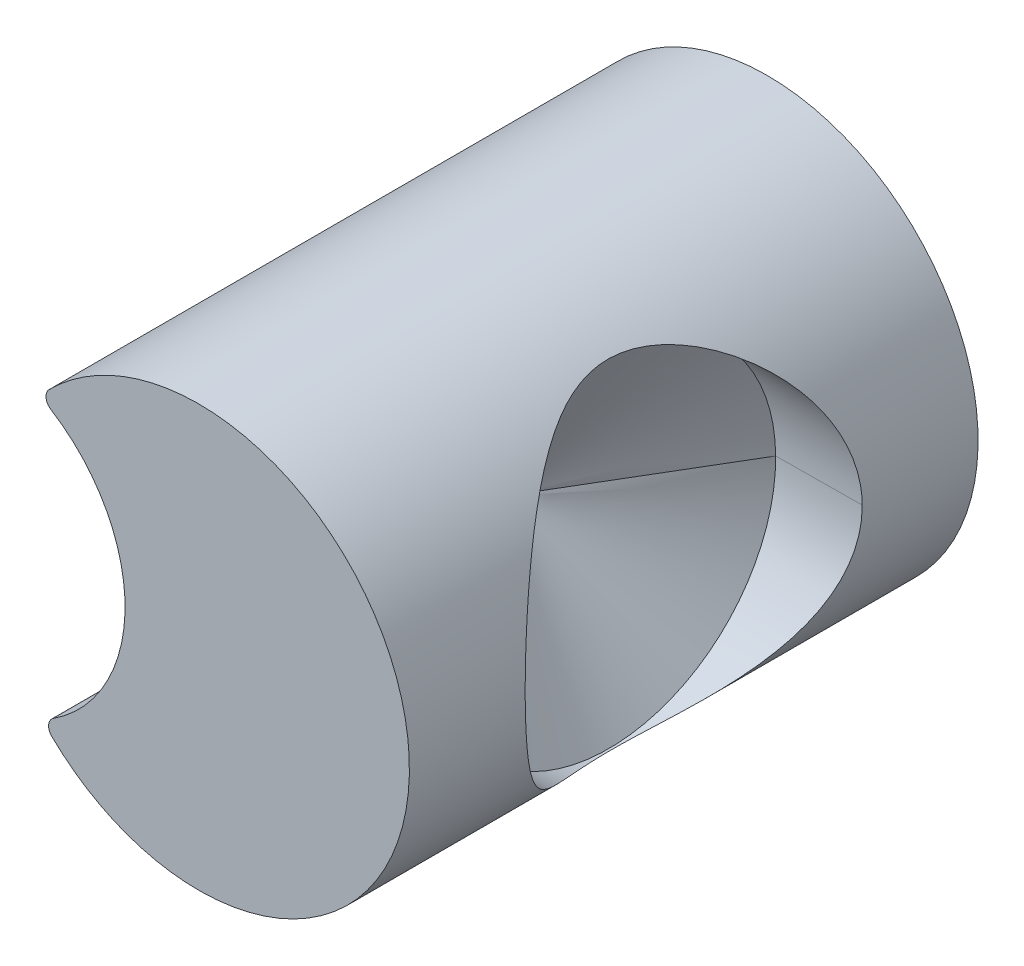
ISO-10303-21;
HEADER;
FILE_DESCRIPTION(('STEP AP214'),'2;1');
FILE_NAME('part.step','',(''),(''),'','','');
FILE_SCHEMA(('AUTOMOTIVE_DESIGN { 1 0 10303 214 1 1 1 1 }'));
ENDSEC;
DATA;
#1=APPLICATION_CONTEXT('core data for automotive mechanical design processes');
#2=APPLICATION_PROTOCOL_DEFINITION('international standard','automotive_design',2000,#1);
#3=PRODUCT_CONTEXT('',#1,'mechanical');
#4=PRODUCT('Part','Part','',(#3));
#5=PRODUCT_RELATED_PRODUCT_CATEGORY('part','',(#4));
#6=PRODUCT_DEFINITION_FORMATION('','',#4);
#7=PRODUCT_DEFINITION_CONTEXT('part definition',#1,'design');
#8=PRODUCT_DEFINITION('design','',#6,#7);
#9=PRODUCT_DEFINITION_SHAPE('','',#8);
#10=(LENGTH_UNIT() NAMED_UNIT(*) SI_UNIT(.MILLI.,.METRE.));
#11=(NAMED_UNIT(*) PLANE_ANGLE_UNIT() SI_UNIT($,.RADIAN.));
#12=(NAMED_UNIT(*) SI_UNIT($,.STERADIAN.) SOLID_ANGLE_UNIT());
#13=UNCERTAINTY_MEASURE_WITH_UNIT(LENGTH_MEASURE(1.E-05),#10,'distance_accuracy_value','');
#14=(GEOMETRIC_REPRESENTATION_CONTEXT(3) GLOBAL_UNCERTAINTY_ASSIGNED_CONTEXT((#13)) GLOBAL_UNIT_ASSIGNED_CONTEXT((#10,
#11,#12)) REPRESENTATION_CONTEXT('',''));
#15=CARTESIAN_POINT('',(0.,0.,0.));
#16=DIRECTION('',(0.,0.,1.));
#17=DIRECTION('',(1.,0.,0.));
#18=AXIS2_PLACEMENT_3D('',#15,#16,#17);
#19=CARTESIAN_POINT('',(0.859064267056033,1.14052531473067,-15.9));
#20=DIRECTION('',(0.,0.,-1.));
#21=DIRECTION('',(0.00912224846441318,-0.99995839142584,0.));
#22=AXIS2_PLACEMENT_3D('',#19,#20,#21);
#23=CYLINDRICAL_SURFACE('',#22,0.1);
#24=DIRECTION('',(0.,0.,1.));
#25=VECTOR('',#24,1.);
#26=CARTESIAN_POINT('',(0.787905898189581,1.21078549773711,-15.9));
#27=LINE('',#26,#25);
#28=CARTESIAN_POINT('',(0.787905898189581,1.21078549773711,-21.3));
#29=VERTEX_POINT('',#28);
#30=CARTESIAN_POINT('',(0.787905898189581,1.21078549773711,-15.9));
#31=VERTEX_POINT('',#30);
#32=EDGE_CURVE('E125',#29,#31,#27,.T.);
#33=ORIENTED_EDGE('',*,*,#32,.F.);
#34=CARTESIAN_POINT('',(0.859064267056033,1.14052531473067,-21.3));
#35=DIRECTION('',(0.,0.,-1.));
#36=DIRECTION('',(-0.530664920304381,-0.847581702467877,0.));
#37=AXIS2_PLACEMENT_3D('',#34,#35,#36);
#38=CIRCLE('',#37,0.1);
#39=CARTESIAN_POINT('',(0.805997774905995,1.05576714452154,-21.3));
#40=VERTEX_POINT('',#39);
#41=EDGE_CURVE('E33',#40,#29,#38,.T.);
#42=ORIENTED_EDGE('',*,*,#41,.F.);
#43=DIRECTION('',(0.,0.,-1.));
#44=VECTOR('',#43,1.);
#45=CARTESIAN_POINT('',(0.805997774905995,1.05576714452154,-15.9));
#46=LINE('',#45,#44);
#47=CARTESIAN_POINT('',(0.805997774905995,1.05576714452154,-15.9));
#48=VERTEX_POINT('',#47);
#49=EDGE_CURVE('E124',#48,#40,#46,.T.);
#50=ORIENTED_EDGE('',*,*,#49,.F.);
#51=CARTESIAN_POINT('',(0.859064267056033,1.14052531473067,-15.9));
#52=DIRECTION('',(0.,0.,1.));
#53=DIRECTION('',(-0.712768314426366,0.701399550862272,0.));
#54=AXIS2_PLACEMENT_3D('',#51,#52,#53);
#55=CIRCLE('',#54,0.1);
#56=EDGE_CURVE('E160',#31,#48,#55,.T.);
#57=ORIENTED_EDGE('',*,*,#56,.F.);
#58=EDGE_LOOP('',(#33,#42,#50,#57));
#59=FACE_BOUND('',#58,.T.);
#60=ADVANCED_FACE('F17',(#59),#23,.T.);
#61=CARTESIAN_POINT('',(0.883664268070162,-1.55606616040022,-15.9));
#62=DIRECTION('',(0.,0.,1.));
#63=DIRECTION('',(-0.00912224846441318,0.99995839142584,0.));
#64=AXIS2_PLACEMENT_3D('',#61,#62,#63);
#65=CYLINDRICAL_SURFACE('',#64,0.1);
#66=DIRECTION('',(0.,0.,-1.));
#67=VECTOR('',#66,1.);
#68=CARTESIAN_POINT('',(0.813799550507037,-1.62761284456977,-15.9));
#69=LINE('',#68,#67);
#70=CARTESIAN_POINT('',(0.813799550507037,-1.62761284456977,-15.9));
#71=VERTEX_POINT('',#70);
#72=CARTESIAN_POINT('',(0.813799550507037,-1.62761284456977,-21.3));
#73=VERTEX_POINT('',#72);
#74=EDGE_CURVE('E181',#71,#73,#69,.T.);
#75=ORIENTED_EDGE('',*,*,#74,.F.);
#76=CARTESIAN_POINT('',(0.883664268070162,-1.55606616040022,-15.9));
#77=DIRECTION('',(0.,0.,1.));
#78=DIRECTION('',(-0.546039659703844,0.837759327032836,0.));
#79=AXIS2_PLACEMENT_3D('',#76,#77,#78);
#80=CIRCLE('',#79,0.1);
#81=CARTESIAN_POINT('',(0.829060302079254,-1.47229022766602,-15.9));
#82=VERTEX_POINT('',#81);
#83=EDGE_CURVE('E161',#82,#71,#80,.T.);
#84=ORIENTED_EDGE('',*,*,#83,.F.);
#85=DIRECTION('',(0.,0.,1.));
#86=VECTOR('',#85,1.);
#87=CARTESIAN_POINT('',(0.829060301980897,-1.47229022773692,-21.3));
#88=LINE('',#87,#86);
#89=CARTESIAN_POINT('',(0.829060302078254,-1.47229022766603,-21.3));
#90=VERTEX_POINT('',#89);
#91=EDGE_CURVE('E137',#90,#82,#88,.T.);
#92=ORIENTED_EDGE('',*,*,#91,.F.);
#93=CARTESIAN_POINT('',(0.883664268070162,-1.55606616040022,-21.3));
#94=DIRECTION('',(0.,0.,-1.));
#95=DIRECTION('',(-0.699853538301384,-0.714286374591476,0.));
#96=AXIS2_PLACEMENT_3D('',#93,#94,#95);
#97=CIRCLE('',#96,0.1);
#98=EDGE_CURVE('E11',#73,#90,#97,.T.);
#99=ORIENTED_EDGE('',*,*,#98,.F.);
#100=EDGE_LOOP('',(#75,#84,#92,#99));
#101=FACE_BOUND('',#100,.T.);
#102=ADVANCED_FACE('F231',(#101),#65,.T.);
#103=CARTESIAN_POINT('',(1.10999070188026,-0.205593522633042,-21.3));
#104=DIRECTION('',(0.,0.,1.));
#105=DIRECTION('',(1.,0.,0.));
#106=AXIS2_PLACEMENT_3D('',#103,#104,#105);
#107=PLANE('',#106);
#108=ORIENTED_EDGE('',*,*,#41,.T.);
#109=CARTESIAN_POINT('',(2.20994493244869,-0.195559049322187,-21.3));
#110=DIRECTION('',(0.,0.,-1.));
#111=DIRECTION('',(-0.711078898816483,0.70311222408513,0.));
#112=AXIS2_PLACEMENT_3D('',#109,#110,#111);
#113=CIRCLE('',#112,2.);
#114=CARTESIAN_POINT('',(2.19170043551986,1.80435773352949,-21.3));
#115=VERTEX_POINT('',#114);
#116=EDGE_CURVE('E176',#29,#115,#113,.T.);
#117=ORIENTED_EDGE('',*,*,#116,.T.);
#118=CARTESIAN_POINT('',(2.20994493244869,-0.195559049322187,-21.3));
#119=DIRECTION('',(0.,0.,-1.));
#120=DIRECTION('',(-0.0091222484644134,0.99995839142584,0.));
#121=AXIS2_PLACEMENT_3D('',#118,#119,#120);
#122=CIRCLE('',#121,2.);
#123=CARTESIAN_POINT('',(2.22818942937751,-2.19547583217387,-21.3));
#124=VERTEX_POINT('',#123);
#125=EDGE_CURVE('E170',#115,#124,#122,.T.);
#126=ORIENTED_EDGE('',*,*,#125,.T.);
#127=CARTESIAN_POINT('',(2.20994493244869,-0.195559049322187,-21.3));
#128=DIRECTION('',(0.,0.,-1.));
#129=DIRECTION('',(0.0091222484644134,-0.99995839142584,0.));
#130=AXIS2_PLACEMENT_3D('',#127,#128,#129);
#131=CIRCLE('',#130,2.);
#132=EDGE_CURVE('E184',#124,#73,#131,.T.);
#133=ORIENTED_EDGE('',*,*,#132,.T.);
#134=ORIENTED_EDGE('',*,*,#98,.T.);
#135=CARTESIAN_POINT('',(0.0100364713118391,-0.215627995943897,-21.3));
#136=DIRECTION('',(0.,0.,1.));
#137=DIRECTION('',(0.5460158871779,-0.837774821147861,0.));
#138=AXIS2_PLACEMENT_3D('',#135,#136,#137);
#139=CIRCLE('',#138,1.5);
#140=EDGE_CURVE('E132',#90,#40,#139,.T.);
#141=ORIENTED_EDGE('',*,*,#140,.T.);
#142=EDGE_LOOP('',(#108,#117,#126,#133,#134,#141));
#143=FACE_BOUND('',#142,.T.);
#144=ADVANCED_FACE('F133',(#143),#107,.F.);
#145=CARTESIAN_POINT('',(4.94783100817264,-0.170582333026624,-18.6));
#146=DIRECTION('',(-0.99995839142584,-0.00912224846441337,0.));
#147=DIRECTION('',(0.,0.,1.));
#148=AXIS2_PLACEMENT_3D('',#145,#146,#147);
#149=CYLINDRICAL_SURFACE('',#148,1.6);
#150=DIRECTION('',(-0.99995839142584,-0.00912224846441337,0.));
#151=VECTOR('',#150,1.);
#152=CARTESIAN_POINT('',(4.20986171530037,-0.177314552393361,-20.2));
#153=LINE('',#152,#151);
#154=CARTESIAN_POINT('',(4.20986171530037,-0.177314552393361,-20.2));
#155=VERTEX_POINT('',#154);
#156=CARTESIAN_POINT('',(3.38789591754833,-0.184813040631109,-20.2));
#157=VERTEX_POINT('',#156);
#158=EDGE_CURVE('E191',#155,#157,#153,.T.);
#159=ORIENTED_EDGE('',*,*,#158,.F.);
#160=CARTESIAN_POINT('',(4.2098617165689,-0.177314691447059,-17.));
#161=CARTESIAN_POINT('',(4.20951826289335,-0.138676568935011,-16.9999914642174));
#162=CARTESIAN_POINT('',(4.2080373869612,-0.100055399010085,-17.0013994091209));
#163=CARTESIAN_POINT('',(4.20287276223151,-0.0231875344703276,-17.0069822403795));
#164=CARTESIAN_POINT('',(4.19919051524847,0.0150593973929833,-17.0111552405749));
#165=CARTESIAN_POINT('',(4.18972991364486,0.0906086075395436,-17.0221610820099));
#166=CARTESIAN_POINT('',(4.18396741617088,0.127915807087014,-17.0289738292892));
#167=CARTESIAN_POINT('',(4.17047195058851,0.201604851219098,-17.04514023906));
#168=CARTESIAN_POINT('',(4.16273874005005,0.237986581349748,-17.0544942141734));
#169=CARTESIAN_POINT('',(4.13684748229866,0.345205749710934,-17.0861141202375));
#170=CARTESIAN_POINT('',(4.11596470322685,0.414369699836636,-17.1119760710889));
#171=CARTESIAN_POINT('',(4.06838476629532,0.546859782325641,-17.1720326204531));
#172=CARTESIAN_POINT('',(4.04167686896103,0.610174820281108,-17.206242623877));
#173=CARTESIAN_POINT('',(3.97398380407412,0.751122385087145,-17.2949079321056));
#174=CARTESIAN_POINT('',(3.93126063911711,0.826096986704635,-17.352268881509));
#175=CARTESIAN_POINT('',(3.84176369370452,0.963722636385902,-17.4778393396997));
#176=CARTESIAN_POINT('',(3.79497937162907,1.02634014271891,-17.5460774908468));
#177=CARTESIAN_POINT('',(3.70067320053366,1.13982247611321,-17.693419321779));
#178=CARTESIAN_POINT('',(3.6531514120682,1.1904853460582,-17.7726780431666));
#179=CARTESIAN_POINT('',(3.5636153803389,1.27802585053404,-17.9412317762391));
#180=CARTESIAN_POINT('',(3.52158295959367,1.31494977226061,-18.0304917459001));
#181=CARTESIAN_POINT('',(3.46648643421586,1.36065637293515,-18.179102638409));
#182=CARTESIAN_POINT('',(3.44870198402533,1.3747301366058,-18.2350485646424));
#183=CARTESIAN_POINT('',(3.42002744880993,1.39693293967146,-18.3497692998584));
#184=CARTESIAN_POINT('',(3.40912049526159,1.40507653173834,-18.408536803926));
#185=CARTESIAN_POINT('',(3.39597765282869,1.41484595298938,-18.528153796628));
#186=CARTESIAN_POINT('',(3.39381814722745,1.41641437145647,-18.5890169646896));
#187=CARTESIAN_POINT('',(3.39884305713983,1.41270916108346,-18.7101637076355));
#188=CARTESIAN_POINT('',(3.40603538423331,1.40742973903119,-18.7704467482525));
#189=CARTESIAN_POINT('',(3.43010495976111,1.3891998755366,-18.8977781680322));
#190=CARTESIAN_POINT('',(3.44832275986028,1.37517740047546,-18.9644071969741));
#191=CARTESIAN_POINT('',(3.49197272587509,1.33975593056986,-19.0932291626657));
#192=CARTESIAN_POINT('',(3.5174261165306,1.31833519346693,-19.155408364525));
#193=CARTESIAN_POINT('',(3.58600114586635,1.25684764261908,-19.3045280462915));
#194=CARTESIAN_POINT('',(3.63166220238681,1.21278953038089,-19.388639245477));
#195=CARTESIAN_POINT('',(3.72539390279468,1.11142928994524,-19.5469707646743));
#196=CARTESIAN_POINT('',(3.77346805148424,1.05410743432494,-19.6211760896499));
#197=CARTESIAN_POINT('',(3.8686925932507,0.924790484492938,-19.7610149606991));
#198=CARTESIAN_POINT('',(3.91578459546587,0.852446297181833,-19.8263686992811));
#199=CARTESIAN_POINT('',(4.00327047185228,0.694435368680924,-19.9440726174405));
#200=CARTESIAN_POINT('',(4.04368135609833,0.60880357113084,-19.996455994315));
#201=CARTESIAN_POINT('',(4.10353057892887,0.451922102682627,-20.0724719072038));
#202=CARTESIAN_POINT('',(4.12565938775456,0.383598889872904,-20.1000411407681));
#203=CARTESIAN_POINT('',(4.16283480939818,0.24209206070615,-20.1457271110552));
#204=CARTESIAN_POINT('',(4.17789649164566,0.168919169472636,-20.1638639697316));
#205=CARTESIAN_POINT('',(4.19535289393033,0.0497703939439552,-20.1844331865607));
#206=CARTESIAN_POINT('',(4.20040652607407,0.00473515779086412,-20.190249448025));
#207=CARTESIAN_POINT('',(4.20746070135784,-0.0859555536814186,-20.1980408100671));
#208=CARTESIAN_POINT('',(4.20945760538687,-0.131611703106374,-20.2000113329631));
#209=CARTESIAN_POINT('',(4.20986171530037,-0.177314552393361,-20.2));
#210=B_SPLINE_CURVE_WITH_KNOTS('',3,(#160,#161,#162,#163,#164,#165,#166,#167,#168,#169,#170,
#171,#172,#173,#174,#175,#176,#177,#178,#179,#180,#181,#182,#183,#184,#185,#186,#187,#188,#189,
#190,#191,#192,#193,#194,#195,#196,#197,#198,#199,#200,#201,#202,#203,#204,#205,#206,#207,#208,
#209),.UNSPECIFIED.,.F.,.F.,(4,2,2,2,2,2,2,2,2,2,2,2,2,2,2,2,2,2,2,2,2,2,2,2,4),(0.,
0.115866089700192,0.231653223551607,0.346575763938184,0.461512448513907,0.690623323274291,
0.920160223493866,1.22936497088209,1.53939780649484,1.85434344889354,2.16821820445058,
2.34873881668407,2.52881492363002,2.71046012068607,2.89225908823673,3.1025344875362,
3.31343318479216,3.62786480348898,3.94276712309583,4.26602806671888,4.58845287531248,
4.81833506073101,5.04772480902034,5.18454717180626,5.32153229868398),.UNSPECIFIED.);
#211=CARTESIAN_POINT('',(4.20986171593464,-0.17731462192021,-17.));
#212=VERTEX_POINT('',#211);
#213=EDGE_CURVE('E20',#212,#155,#210,.T.);
#214=ORIENTED_EDGE('',*,*,#213,.F.);
#215=DIRECTION('',(-0.99995839142584,-0.00912224846441337,0.));
#216=VECTOR('',#215,1.);
#217=CARTESIAN_POINT('',(4.94783100817264,-0.170582333026624,-17.));
#218=LINE('',#217,#216);
#219=CARTESIAN_POINT('',(3.38789591754837,-0.184813040631108,-17.));
#220=VERTEX_POINT('',#219);
#221=EDGE_CURVE('E64',#212,#220,#218,.T.);
#222=ORIENTED_EDGE('',*,*,#221,.T.);
#223=CARTESIAN_POINT('',(3.38789591754833,-0.184813040631109,-18.6));
#224=DIRECTION('',(0.99995839142584,0.00912224846441337,0.));
#225=DIRECTION('',(0.,0.,-1.));
#226=AXIS2_PLACEMENT_3D('',#223,#224,#225);
#227=CIRCLE('',#226,1.6);
#228=EDGE_CURVE('E129',#157,#220,#227,.T.);
#229=ORIENTED_EDGE('',*,*,#228,.F.);
#230=EDGE_LOOP('',(#159,#214,#222,#229));
#231=FACE_BOUND('',#230,.T.);
#232=ADVANCED_FACE('F222',(#231),#149,.F.);
#233=CARTESIAN_POINT('',(2.92565871656528,-0.189029858683758,-18.6));
#234=DIRECTION('',(0.99995839142584,0.00912224846441337,0.));
#235=DIRECTION('',(0.,0.,-1.));
#236=AXIS2_PLACEMENT_3D('',#233,#234,#235);
#237=CONICAL_SURFACE('',#236,0.8306760999543,1.0297442575);
#238=DIRECTION('',(0.515016644910158,0.00469830528796301,0.857167300702089));
#239=VECTOR('',#238,1.);
#240=CARTESIAN_POINT('',(2.42655892863003,-0.19358296040591,-18.6));
#241=LINE('',#240,#239);
#242=CARTESIAN_POINT('',(2.42655892863003,-0.19358296040591,-18.6));
#243=VERTEX_POINT('',#242);
#244=EDGE_CURVE('E47',#243,#220,#241,.T.);
#245=ORIENTED_EDGE('',*,*,#244,.F.);
#246=DIRECTION('',(0.515016644910158,0.00469830528796301,-0.857167300702089));
#247=VECTOR('',#246,1.);
#248=CARTESIAN_POINT('',(2.42655892863003,-0.19358296040591,-18.6));
#249=LINE('',#248,#247);
#250=EDGE_CURVE('E190',#243,#157,#249,.T.);
#251=ORIENTED_EDGE('',*,*,#250,.T.);
#252=ORIENTED_EDGE('',*,*,#228,.T.);
#253=EDGE_LOOP('',(#245,#251,#252));
#254=FACE_BOUND('',#253,.T.);
#255=ADVANCED_FACE('F218',(#254),#237,.F.);
#256=CARTESIAN_POINT('',(2.92565871656528,-0.189029858683758,-18.6));
#257=DIRECTION('',(0.99995839142584,0.00912224846441337,0.));
#258=DIRECTION('',(0.,0.,-1.));
#259=AXIS2_PLACEMENT_3D('',#256,#257,#258);
#260=CONICAL_SURFACE('',#259,0.8306760999543,1.0297442575);
#261=ORIENTED_EDGE('',*,*,#250,.F.);
#262=ORIENTED_EDGE('',*,*,#244,.T.);
#263=CARTESIAN_POINT('',(3.38789591754833,-0.184813040631109,-18.6));
#264=DIRECTION('',(0.99995839142584,0.00912224846441337,0.));
#265=DIRECTION('',(0.,0.,1.));
#266=AXIS2_PLACEMENT_3D('',#263,#264,#265);
#267=CIRCLE('',#266,1.6);
#268=EDGE_CURVE('E186',#220,#157,#267,.T.);
#269=ORIENTED_EDGE('',*,*,#268,.T.);
#270=EDGE_LOOP('',(#261,#262,#269));
#271=FACE_BOUND('',#270,.T.);
#272=ADVANCED_FACE('F221',(#271),#260,.F.);
#273=CARTESIAN_POINT('',(4.94783100817264,-0.170582333026624,-18.6));
#274=DIRECTION('',(-0.99995839142584,-0.00912224846441337,0.));
#275=DIRECTION('',(0.,0.,1.));
#276=AXIS2_PLACEMENT_3D('',#273,#274,#275);
#277=CYLINDRICAL_SURFACE('',#276,1.6);
#278=ORIENTED_EDGE('',*,*,#221,.F.);
#279=CARTESIAN_POINT('',(4.20986171530037,-0.177314552393361,-20.2));
#280=CARTESIAN_POINT('',(4.21022321989086,-0.215952511810768,-20.2000085324248));
#281=CARTESIAN_POINT('',(4.20944718215436,-0.254594272088519,-20.1986005840491));
#282=CARTESIAN_POINT('',(4.20568576849789,-0.331543567854824,-20.1930177456873));
#283=CARTESIAN_POINT('',(4.20270189847157,-0.369851313154052,-20.188844741862));
#284=CARTESIAN_POINT('',(4.1946211656058,-0.445560547761187,-20.1778388931056));
#285=CARTESIAN_POINT('',(4.18954024705807,-0.482966668224346,-20.1710261421376));
#286=CARTESIAN_POINT('',(4.17739138536468,-0.556889656542047,-20.154859724959));
#287=CARTESIAN_POINT('',(4.17032319774106,-0.593406414384368,-20.1455057461259));
#288=CARTESIAN_POINT('',(4.14639231902149,-0.701080091086235,-20.1138858289809));
#289=CARTESIAN_POINT('',(4.12677481899486,-0.770613509098558,-20.0880238708053));
#290=CARTESIAN_POINT('',(4.08161990488075,-0.903949573822021,-20.0279673070828));
#291=CARTESIAN_POINT('',(4.05607155070328,-0.967741323897273,-19.9937572966246));
#292=CARTESIAN_POINT('',(3.99096115107606,-1.10990040142905,-19.9050919707858));
#293=CARTESIAN_POINT('',(3.94961290710335,-1.18564195291227,-19.8477310105583));
#294=CARTESIAN_POINT('',(3.86264165184872,-1.32487745001575,-19.7221605301844));
#295=CARTESIAN_POINT('',(3.81700748877284,-1.38833805178081,-19.6539223676594));
#296=CARTESIAN_POINT('',(3.72478734854765,-1.50352198527716,-19.5065805128041));
#297=CARTESIAN_POINT('',(3.67819774753755,-1.55504339237003,-19.4273217788567));
#298=CARTESIAN_POINT('',(3.59027368575118,-1.64420278419975,-19.2587680190453));
#299=CARTESIAN_POINT('',(3.5489218949275,-1.68188738012681,-19.1695080352599));
#300=CARTESIAN_POINT('',(3.49466841692727,-1.72859151925796,-19.020897130115));
#301=CARTESIAN_POINT('',(3.47714369460463,-1.74298738593407,-18.9649512061878));
#302=CARTESIAN_POINT('',(3.44887901491717,-1.76570960586306,-18.8502304774684));
#303=CARTESIAN_POINT('',(3.43812245732702,-1.77405081711089,-18.7914629775872));
#304=CARTESIAN_POINT('',(3.42516005497482,-1.7840583697565,-18.6718459965888));
#305=CARTESIAN_POINT('',(3.42302953330299,-1.78566591655486,-18.6109828360842));
#306=CARTESIAN_POINT('',(3.42798602836244,-1.78186963562682,-18.4898361102987));
#307=CARTESIAN_POINT('',(3.43508084968887,-1.77645987129879,-18.4295530792887));
#308=CARTESIAN_POINT('',(3.45881385459322,-1.75779390935957,-18.3022216600067));
#309=CARTESIAN_POINT('',(3.47677281135202,-1.74344139763212,-18.2355926230604));
#310=CARTESIAN_POINT('',(3.51976931389717,-1.70722946353377,-18.1067706434701));
#311=CARTESIAN_POINT('',(3.54482768422848,-1.68534791529983,-18.044591435723));
#312=CARTESIAN_POINT('',(3.61226955960312,-1.62261950479684,-17.8954717449695));
#313=CARTESIAN_POINT('',(3.65711924232139,-1.57773567953459,-17.8113605431352));
#314=CARTESIAN_POINT('',(3.74898616949686,-1.47468225451295,-17.6530290211322));
#315=CARTESIAN_POINT('',(3.79600655826295,-1.41649286667973,-17.5788236959951));
#316=CARTESIAN_POINT('',(3.88885603253192,-1.28546014617983,-17.4389848313973));
#317=CARTESIAN_POINT('',(3.93462036810122,-1.21226884425128,-17.373631099084));
#318=CARTESIAN_POINT('',(4.01920896684043,-1.05268810101939,-17.2559271986569));
#319=CARTESIAN_POINT('',(4.05805087478386,-0.966333287240875,-17.2035438332104));
#320=CARTESIAN_POINT('',(4.11502801034148,-0.808386030529547,-17.1275279522455));
#321=CARTESIAN_POINT('',(4.13590665282695,-0.739670475375183,-17.0999587358198));
#322=CARTESIAN_POINT('',(4.17049424797806,-0.597508979575386,-17.0542727996936));
#323=CARTESIAN_POINT('',(4.18421846323644,-0.524073487340993,-17.0361359580351));
#324=CARTESIAN_POINT('',(4.19949821143378,-0.40462614997645,-17.0155667798028));
#325=CARTESIAN_POINT('',(4.20372937943687,-0.359506288160598,-17.0097505342882));
#326=CARTESIAN_POINT('',(4.20912782944903,-0.268702131038338,-17.0019591911325));
#327=CARTESIAN_POINT('',(4.2102914607002,-0.223017228137392,-16.999988671116));
#328=CARTESIAN_POINT('',(4.2098617165689,-0.177314691447059,-17.));
#329=B_SPLINE_CURVE_WITH_KNOTS('',3,(#279,#280,#281,#282,#283,#284,#285,#286,#287,#288,#289,
#290,#291,#292,#293,#294,#295,#296,#297,#298,#299,#300,#301,#302,#303,#304,#305,#306,#307,#308,
#309,#310,#311,#312,#313,#314,#315,#316,#317,#318,#319,#320,#321,#322,#323,#324,#325,#326,#327,
#328),.UNSPECIFIED.,.F.,.F.,(4,2,2,2,2,2,2,2,2,2,2,2,2,2,2,2,2,2,2,2,2,2,2,2,4),(0.,
0.115866094413286,0.231653232936664,0.346575777870619,0.461512467005332,0.690623350537378,
0.920160259566321,1.22936502759299,1.53939788440795,1.85434354830583,2.16821832383279,
2.34873891406062,2.52881499901821,2.71046017202645,2.89225911599117,3.10253455209293,
3.31343328626244,3.62786494640878,3.94276730727092,4.26602828005254,4.58845311716516,
4.81833527728144,5.04772500020693,5.1845471290786,5.32153202028174),.UNSPECIFIED.);
#330=EDGE_CURVE('E200',#155,#212,#329,.T.);
#331=ORIENTED_EDGE('',*,*,#330,.F.);
#332=ORIENTED_EDGE('',*,*,#158,.T.);
#333=ORIENTED_EDGE('',*,*,#268,.F.);
#334=EDGE_LOOP('',(#278,#331,#332,#333));
#335=FACE_BOUND('',#334,.T.);
#336=ADVANCED_FACE('F207',(#335),#277,.F.);
#337=CARTESIAN_POINT('',(2.20994493244869,-0.195559049322187,-15.9));
#338=DIRECTION('',(0.,0.,-1.));
#339=DIRECTION('',(0.0091222484644134,-0.99995839142584,0.));
#340=AXIS2_PLACEMENT_3D('',#337,#338,#339);
#341=CYLINDRICAL_SURFACE('',#340,2.);
#342=ORIENTED_EDGE('',*,*,#213,.T.);
#343=ORIENTED_EDGE('',*,*,#330,.T.);
#344=EDGE_LOOP('',(#342,#343));
#345=FACE_BOUND('',#344,.T.);
#346=ORIENTED_EDGE('',*,*,#125,.F.);
#347=ORIENTED_EDGE('',*,*,#116,.F.);
#348=ORIENTED_EDGE('',*,*,#32,.T.);
#349=CARTESIAN_POINT('',(2.20994493244869,-0.195559049322187,-15.9));
#350=DIRECTION('',(0.,0.,1.));
#351=DIRECTION('',(-0.0091222484644134,0.99995839142584,0.));
#352=AXIS2_PLACEMENT_3D('',#349,#350,#351);
#353=CIRCLE('',#352,2.);
#354=CARTESIAN_POINT('',(2.19170043551986,1.80435773352949,-15.9));
#355=VERTEX_POINT('',#354);
#356=EDGE_CURVE('E156',#355,#31,#353,.T.);
#357=ORIENTED_EDGE('',*,*,#356,.F.);
#358=CARTESIAN_POINT('',(2.20994493244869,-0.195559049322187,-15.9));
#359=DIRECTION('',(0.,0.,1.));
#360=DIRECTION('',(0.0091222484644134,-0.99995839142584,0.));
#361=AXIS2_PLACEMENT_3D('',#358,#359,#360);
#362=CIRCLE('',#361,2.);
#363=CARTESIAN_POINT('',(2.22818942937751,-2.19547583217387,-15.9));
#364=VERTEX_POINT('',#363);
#365=EDGE_CURVE('E152',#364,#355,#362,.T.);
#366=ORIENTED_EDGE('',*,*,#365,.F.);
#367=CARTESIAN_POINT('',(2.20994493244869,-0.195559049322187,-15.9));
#368=DIRECTION('',(0.,0.,1.));
#369=DIRECTION('',(-0.698133158301132,-0.715967941517276,0.));
#370=AXIS2_PLACEMENT_3D('',#367,#368,#369);
#371=CIRCLE('',#370,2.);
#372=EDGE_CURVE('E165',#71,#364,#371,.T.);
#373=ORIENTED_EDGE('',*,*,#372,.F.);
#374=ORIENTED_EDGE('',*,*,#74,.T.);
#375=ORIENTED_EDGE('',*,*,#132,.F.);
#376=EDGE_LOOP('',(#346,#347,#348,#357,#366,#373,#374,#375));
#377=FACE_BOUND('',#376,.T.);
#378=ADVANCED_FACE('F211',(#345,#377),#341,.T.);
#379=CARTESIAN_POINT('',(1.10999070188026,-0.205593522633042,-15.9));
#380=DIRECTION('',(0.,0.,1.));
#381=DIRECTION('',(1.,0.,0.));
#382=AXIS2_PLACEMENT_3D('',#379,#380,#381);
#383=PLANE('',#382);
#384=ORIENTED_EDGE('',*,*,#365,.T.);
#385=ORIENTED_EDGE('',*,*,#356,.T.);
#386=ORIENTED_EDGE('',*,*,#56,.T.);
#387=CARTESIAN_POINT('',(0.0100364713118391,-0.215627995943897,-15.9));
#388=DIRECTION('',(0.,0.,-1.));
#389=DIRECTION('',(0.530640869128795,0.847596760264123,0.));
#390=AXIS2_PLACEMENT_3D('',#387,#388,#389);
#391=CIRCLE('',#390,1.5);
#392=EDGE_CURVE('E142',#48,#82,#391,.T.);
#393=ORIENTED_EDGE('',*,*,#392,.T.);
#394=ORIENTED_EDGE('',*,*,#83,.T.);
#395=ORIENTED_EDGE('',*,*,#372,.T.);
#396=EDGE_LOOP('',(#384,#385,#386,#393,#394,#395));
#397=FACE_BOUND('',#396,.T.);
#398=ADVANCED_FACE('F215',(#397),#383,.T.);
#399=CARTESIAN_POINT('',(0.0100364713118391,-0.215627995943897,-15.9));
#400=DIRECTION('',(0.,0.,-1.));
#401=DIRECTION('',(0.00912224846441337,-0.99995839142584,0.));
#402=AXIS2_PLACEMENT_3D('',#399,#400,#401);
#403=CYLINDRICAL_SURFACE('',#402,1.5);
#404=ORIENTED_EDGE('',*,*,#49,.T.);
#405=ORIENTED_EDGE('',*,*,#140,.F.);
#406=ORIENTED_EDGE('',*,*,#91,.T.);
#407=ORIENTED_EDGE('',*,*,#392,.F.);
#408=EDGE_LOOP('',(#404,#405,#406,#407));
#409=FACE_BOUND('',#408,.T.);
#410=ADVANCED_FACE('F140',(#409),#403,.F.);
#411=CLOSED_SHELL('',(#60,#102,#144,#232,#255,#272,#336,#378,#398,#410));
#412=MANIFOLD_SOLID_BREP('B1',#411);
#413=ADVANCED_BREP_SHAPE_REPRESENTATION('',(#18,#412),#14);
#414=SHAPE_DEFINITION_REPRESENTATION(#9,#413);
ENDSEC;
END-ISO-10303-21;
